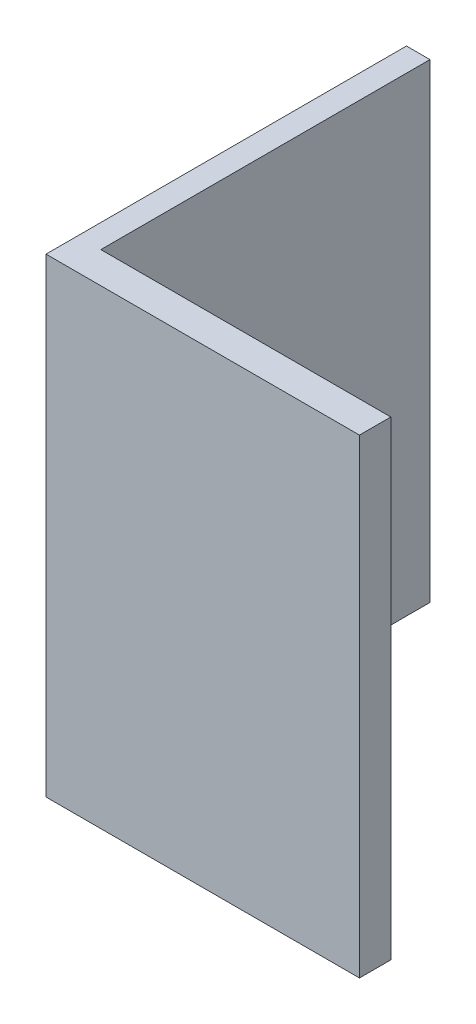
ISO-10303-21;
HEADER;
FILE_DESCRIPTION(('STEP AP214'),'2;1');
FILE_NAME('part.step','',(''),(''),'','','');
FILE_SCHEMA(('AUTOMOTIVE_DESIGN { 1 0 10303 214 1 1 1 1 }'));
ENDSEC;
DATA;
#1=APPLICATION_CONTEXT('core data for automotive mechanical design processes');
#2=APPLICATION_PROTOCOL_DEFINITION('international standard','automotive_design',2000,#1);
#3=PRODUCT_CONTEXT('',#1,'mechanical');
#4=PRODUCT('Part','Part','',(#3));
#5=PRODUCT_RELATED_PRODUCT_CATEGORY('part','',(#4));
#6=PRODUCT_DEFINITION_FORMATION('','',#4);
#7=PRODUCT_DEFINITION_CONTEXT('part definition',#1,'design');
#8=PRODUCT_DEFINITION('design','',#6,#7);
#9=PRODUCT_DEFINITION_SHAPE('','',#8);
#10=(LENGTH_UNIT() NAMED_UNIT(*) SI_UNIT(.MILLI.,.METRE.));
#11=(NAMED_UNIT(*) PLANE_ANGLE_UNIT() SI_UNIT($,.RADIAN.));
#12=(NAMED_UNIT(*) SI_UNIT($,.STERADIAN.) SOLID_ANGLE_UNIT());
#13=UNCERTAINTY_MEASURE_WITH_UNIT(LENGTH_MEASURE(1.E-05),#10,'distance_accuracy_value','');
#14=(GEOMETRIC_REPRESENTATION_CONTEXT(3) GLOBAL_UNCERTAINTY_ASSIGNED_CONTEXT((#13)) GLOBAL_UNIT_ASSIGNED_CONTEXT((#10,
#11,#12)) REPRESENTATION_CONTEXT('',''));
#15=CARTESIAN_POINT('',(0.,0.,0.));
#16=DIRECTION('',(0.,0.,1.));
#17=DIRECTION('',(1.,0.,0.));
#18=AXIS2_PLACEMENT_3D('',#15,#16,#17);
#19=CARTESIAN_POINT('',(-15.1056244867724,30.,-20.9432038193274));
#20=DIRECTION('',(0.,0.,1.));
#21=DIRECTION('',(1.,0.,0.));
#22=AXIS2_PLACEMENT_3D('',#19,#20,#21);
#23=PLANE('',#22);
#24=DIRECTION('',(-1.,0.,0.));
#25=VECTOR('',#24,1.);
#26=CARTESIAN_POINT('',(-15.1056244867724,0.,-20.9432038193274));
#27=LINE('',#26,#25);
#28=CARTESIAN_POINT('',(-15.1056244867724,0.,-20.9432038193274));
#29=VERTEX_POINT('',#28);
#30=CARTESIAN_POINT('',(-16.6056244867724,0.,-20.9432038193274));
#31=VERTEX_POINT('',#30);
#32=EDGE_CURVE('E119',#29,#31,#27,.T.);
#33=ORIENTED_EDGE('',*,*,#32,.T.);
#34=DIRECTION('',(0.,-1.,0.));
#35=VECTOR('',#34,1.);
#36=CARTESIAN_POINT('',(-16.6056244867724,30.,-20.9432038193274));
#37=LINE('',#36,#35);
#38=CARTESIAN_POINT('',(-16.6056244867724,30.,-20.9432038193274));
#39=VERTEX_POINT('',#38);
#40=EDGE_CURVE('E11',#39,#31,#37,.T.);
#41=ORIENTED_EDGE('',*,*,#40,.F.);
#42=DIRECTION('',(-1.,0.,0.));
#43=VECTOR('',#42,1.);
#44=CARTESIAN_POINT('',(-15.1056244867724,30.,-20.9432038193274));
#45=LINE('',#44,#43);
#46=CARTESIAN_POINT('',(-15.1056244867724,30.,-20.9432038193274));
#47=VERTEX_POINT('',#46);
#48=EDGE_CURVE('E129',#47,#39,#45,.T.);
#49=ORIENTED_EDGE('',*,*,#48,.F.);
#50=DIRECTION('',(0.,-1.,0.));
#51=VECTOR('',#50,1.);
#52=CARTESIAN_POINT('',(-15.1056244867724,30.,-20.9432038193274));
#53=LINE('',#52,#51);
#54=EDGE_CURVE('E115',#47,#29,#53,.T.);
#55=ORIENTED_EDGE('',*,*,#54,.T.);
#56=EDGE_LOOP('',(#33,#41,#49,#55));
#57=FACE_BOUND('',#56,.T.);
#58=ADVANCED_FACE('F35',(#57),#23,.F.);
#59=CARTESIAN_POINT('',(-16.6056244867724,30.,-20.9432038193274));
#60=DIRECTION('',(1.,0.,0.));
#61=DIRECTION('',(0.,0.,-1.));
#62=AXIS2_PLACEMENT_3D('',#59,#60,#61);
#63=PLANE('',#62);
#64=DIRECTION('',(0.,0.,1.));
#65=VECTOR('',#64,1.);
#66=CARTESIAN_POINT('',(-16.6056244867724,0.,-20.9432038193274));
#67=LINE('',#66,#65);
#68=CARTESIAN_POINT('',(-16.6056244867724,0.,2.05679618067255));
#69=VERTEX_POINT('',#68);
#70=EDGE_CURVE('E122',#31,#69,#67,.T.);
#71=ORIENTED_EDGE('',*,*,#70,.T.);
#72=DIRECTION('',(0.,-1.,0.));
#73=VECTOR('',#72,1.);
#74=CARTESIAN_POINT('',(-16.6056244867724,30.,2.05679618067255));
#75=LINE('',#74,#73);
#76=CARTESIAN_POINT('',(-16.6056244867724,30.,2.05679618067255));
#77=VERTEX_POINT('',#76);
#78=EDGE_CURVE('E43',#77,#69,#75,.T.);
#79=ORIENTED_EDGE('',*,*,#78,.F.);
#80=DIRECTION('',(0.,0.,1.));
#81=VECTOR('',#80,1.);
#82=CARTESIAN_POINT('',(-16.6056244867724,30.,-20.9432038193274));
#83=LINE('',#82,#81);
#84=EDGE_CURVE('E88',#39,#77,#83,.T.);
#85=ORIENTED_EDGE('',*,*,#84,.F.);
#86=ORIENTED_EDGE('',*,*,#40,.T.);
#87=EDGE_LOOP('',(#71,#79,#85,#86));
#88=FACE_BOUND('',#87,.T.);
#89=ADVANCED_FACE('F153',(#88),#63,.F.);
#90=CARTESIAN_POINT('',(-16.6056244867724,30.,2.05679618067255));
#91=DIRECTION('',(0.,0.,-1.));
#92=DIRECTION('',(-1.,0.,0.));
#93=AXIS2_PLACEMENT_3D('',#90,#91,#92);
#94=PLANE('',#93);
#95=DIRECTION('',(1.,0.,0.));
#96=VECTOR('',#95,1.);
#97=CARTESIAN_POINT('',(-16.6056244867724,0.,2.05679618067255));
#98=LINE('',#97,#96);
#99=CARTESIAN_POINT('',(3.39437551322756,0.,2.05679618067255));
#100=VERTEX_POINT('',#99);
#101=EDGE_CURVE('E124',#69,#100,#98,.T.);
#102=ORIENTED_EDGE('',*,*,#101,.T.);
#103=DIRECTION('',(0.,-1.,0.));
#104=VECTOR('',#103,1.);
#105=CARTESIAN_POINT('',(3.39437551322756,30.,2.05679618067255));
#106=LINE('',#105,#104);
#107=CARTESIAN_POINT('',(3.39437551322756,30.,2.05679618067255));
#108=VERTEX_POINT('',#107);
#109=EDGE_CURVE('E110',#108,#100,#106,.T.);
#110=ORIENTED_EDGE('',*,*,#109,.F.);
#111=DIRECTION('',(1.,0.,0.));
#112=VECTOR('',#111,1.);
#113=CARTESIAN_POINT('',(-16.6056244867724,30.,2.05679618067255));
#114=LINE('',#113,#112);
#115=EDGE_CURVE('E101',#77,#108,#114,.T.);
#116=ORIENTED_EDGE('',*,*,#115,.F.);
#117=ORIENTED_EDGE('',*,*,#78,.T.);
#118=EDGE_LOOP('',(#102,#110,#116,#117));
#119=FACE_BOUND('',#118,.T.);
#120=ADVANCED_FACE('F135',(#119),#94,.F.);
#121=CARTESIAN_POINT('',(3.39437551322756,30.,2.05679618067255));
#122=DIRECTION('',(-1.,0.,0.));
#123=DIRECTION('',(0.,0.,1.));
#124=AXIS2_PLACEMENT_3D('',#121,#122,#123);
#125=PLANE('',#124);
#126=DIRECTION('',(0.,0.,-1.));
#127=VECTOR('',#126,1.);
#128=CARTESIAN_POINT('',(3.39437551322756,0.,2.05679618067255));
#129=LINE('',#128,#127);
#130=CARTESIAN_POINT('',(3.39437551322756,0.,0.0567961806725525));
#131=VERTEX_POINT('',#130);
#132=EDGE_CURVE('E109',#100,#131,#129,.T.);
#133=ORIENTED_EDGE('',*,*,#132,.T.);
#134=DIRECTION('',(0.,-1.,0.));
#135=VECTOR('',#134,1.);
#136=CARTESIAN_POINT('',(3.39437551322756,30.,0.0567961806725525));
#137=LINE('',#136,#135);
#138=CARTESIAN_POINT('',(3.39437551322756,30.,0.0567961806725525));
#139=VERTEX_POINT('',#138);
#140=EDGE_CURVE('E106',#139,#131,#137,.T.);
#141=ORIENTED_EDGE('',*,*,#140,.F.);
#142=DIRECTION('',(0.,0.,-1.));
#143=VECTOR('',#142,1.);
#144=CARTESIAN_POINT('',(3.39437551322756,30.,2.05679618067255));
#145=LINE('',#144,#143);
#146=EDGE_CURVE('E95',#108,#139,#145,.T.);
#147=ORIENTED_EDGE('',*,*,#146,.F.);
#148=ORIENTED_EDGE('',*,*,#109,.T.);
#149=EDGE_LOOP('',(#133,#141,#147,#148));
#150=FACE_BOUND('',#149,.T.);
#151=ADVANCED_FACE('F107',(#150),#125,.F.);
#152=CARTESIAN_POINT('',(3.39437551322756,30.,0.0567961806725525));
#153=DIRECTION('',(0.,0.,1.));
#154=DIRECTION('',(1.,0.,0.));
#155=AXIS2_PLACEMENT_3D('',#152,#153,#154);
#156=PLANE('',#155);
#157=DIRECTION('',(-1.,0.,0.));
#158=VECTOR('',#157,1.);
#159=CARTESIAN_POINT('',(3.39437551322756,0.,0.0567961806725525));
#160=LINE('',#159,#158);
#161=CARTESIAN_POINT('',(-15.1056244867724,0.,0.0567961806725546));
#162=VERTEX_POINT('',#161);
#163=EDGE_CURVE('E74',#131,#162,#160,.T.);
#164=ORIENTED_EDGE('',*,*,#163,.T.);
#165=DIRECTION('',(0.,-1.,0.));
#166=VECTOR('',#165,1.);
#167=CARTESIAN_POINT('',(-15.1056244867724,30.,0.0567961806725546));
#168=LINE('',#167,#166);
#169=CARTESIAN_POINT('',(-15.1056244867724,30.,0.0567961806725546));
#170=VERTEX_POINT('',#169);
#171=EDGE_CURVE('E111',#170,#162,#168,.T.);
#172=ORIENTED_EDGE('',*,*,#171,.F.);
#173=DIRECTION('',(-1.,0.,0.));
#174=VECTOR('',#173,1.);
#175=CARTESIAN_POINT('',(3.39437551322756,30.,0.0567961806725525));
#176=LINE('',#175,#174);
#177=EDGE_CURVE('E99',#139,#170,#176,.T.);
#178=ORIENTED_EDGE('',*,*,#177,.F.);
#179=ORIENTED_EDGE('',*,*,#140,.T.);
#180=EDGE_LOOP('',(#164,#172,#178,#179));
#181=FACE_BOUND('',#180,.T.);
#182=ADVANCED_FACE('F113',(#181),#156,.F.);
#183=CARTESIAN_POINT('',(-15.1056244867724,30.,0.0567961806725546));
#184=DIRECTION('',(-1.,0.,0.));
#185=DIRECTION('',(0.,0.,1.));
#186=AXIS2_PLACEMENT_3D('',#183,#184,#185);
#187=PLANE('',#186);
#188=DIRECTION('',(0.,0.,-1.));
#189=VECTOR('',#188,1.);
#190=CARTESIAN_POINT('',(-15.1056244867724,0.,0.0567961806725546));
#191=LINE('',#190,#189);
#192=EDGE_CURVE('E80',#162,#29,#191,.T.);
#193=ORIENTED_EDGE('',*,*,#192,.T.);
#194=ORIENTED_EDGE('',*,*,#54,.F.);
#195=DIRECTION('',(0.,0.,-1.));
#196=VECTOR('',#195,1.);
#197=CARTESIAN_POINT('',(-15.1056244867724,30.,0.0567961806725546));
#198=LINE('',#197,#196);
#199=EDGE_CURVE('E51',#170,#47,#198,.T.);
#200=ORIENTED_EDGE('',*,*,#199,.F.);
#201=ORIENTED_EDGE('',*,*,#171,.T.);
#202=EDGE_LOOP('',(#193,#194,#200,#201));
#203=FACE_BOUND('',#202,.T.);
#204=ADVANCED_FACE('F142',(#203),#187,.F.);
#205=CARTESIAN_POINT('',(0.,30.,0.));
#206=DIRECTION('',(0.,1.,0.));
#207=DIRECTION('',(0.,0.,1.));
#208=AXIS2_PLACEMENT_3D('',#205,#206,#207);
#209=PLANE('',#208);
#210=ORIENTED_EDGE('',*,*,#48,.T.);
#211=ORIENTED_EDGE('',*,*,#84,.T.);
#212=ORIENTED_EDGE('',*,*,#115,.T.);
#213=ORIENTED_EDGE('',*,*,#146,.T.);
#214=ORIENTED_EDGE('',*,*,#177,.T.);
#215=ORIENTED_EDGE('',*,*,#199,.T.);
#216=EDGE_LOOP('',(#210,#211,#212,#213,#214,#215));
#217=FACE_BOUND('',#216,.T.);
#218=ADVANCED_FACE('F97',(#217),#209,.T.);
#219=CARTESIAN_POINT('',(0.,0.,0.));
#220=DIRECTION('',(0.,1.,0.));
#221=DIRECTION('',(0.,0.,1.));
#222=AXIS2_PLACEMENT_3D('',#219,#220,#221);
#223=PLANE('',#222);
#224=ORIENTED_EDGE('',*,*,#32,.F.);
#225=ORIENTED_EDGE('',*,*,#192,.F.);
#226=ORIENTED_EDGE('',*,*,#163,.F.);
#227=ORIENTED_EDGE('',*,*,#132,.F.);
#228=ORIENTED_EDGE('',*,*,#101,.F.);
#229=ORIENTED_EDGE('',*,*,#70,.F.);
#230=EDGE_LOOP('',(#224,#225,#226,#227,#228,#229));
#231=FACE_BOUND('',#230,.T.);
#232=ADVANCED_FACE('F138',(#231),#223,.F.);
#233=CLOSED_SHELL('',(#58,#89,#120,#151,#182,#204,#218,#232));
#234=MANIFOLD_SOLID_BREP('B2',#233);
#235=ADVANCED_BREP_SHAPE_REPRESENTATION('',(#18,#234),#14);
#236=SHAPE_DEFINITION_REPRESENTATION(#9,#235);
ENDSEC;
END-ISO-10303-21;
